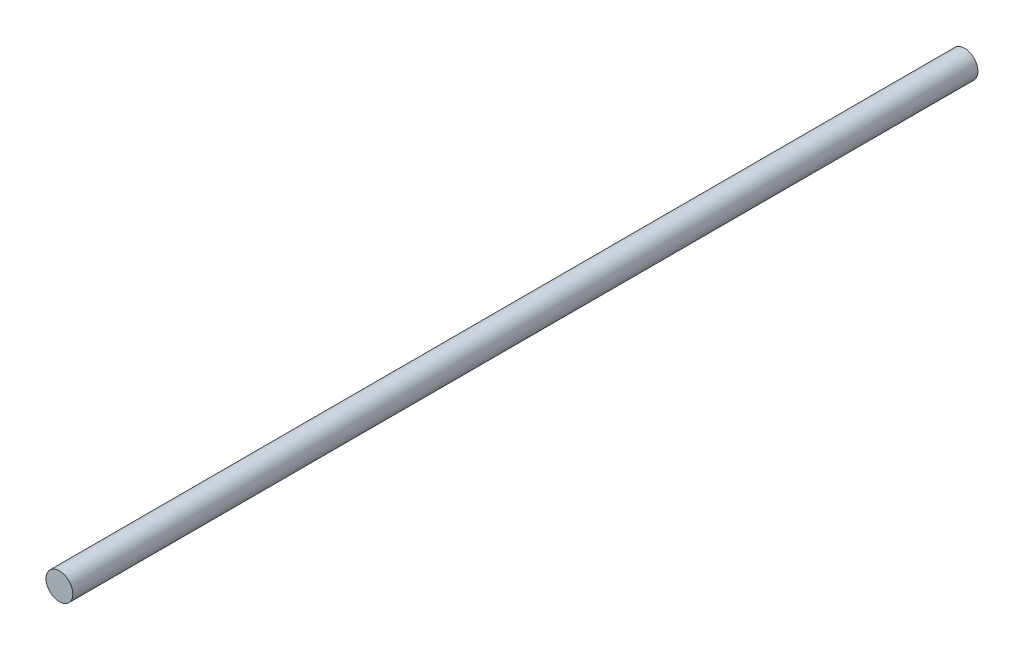
ISO-10303-21;
HEADER;
FILE_DESCRIPTION(('STEP AP214'),'2;1');
FILE_NAME('part.step','',(''),(''),'','','');
FILE_SCHEMA(('AUTOMOTIVE_DESIGN { 1 0 10303 214 1 1 1 1 }'));
ENDSEC;
DATA;
#1=APPLICATION_CONTEXT('core data for automotive mechanical design processes');
#2=APPLICATION_PROTOCOL_DEFINITION('international standard','automotive_design',2000,#1);
#3=PRODUCT_CONTEXT('',#1,'mechanical');
#4=PRODUCT('Part','Part','',(#3));
#5=PRODUCT_RELATED_PRODUCT_CATEGORY('part','',(#4));
#6=PRODUCT_DEFINITION_FORMATION('','',#4);
#7=PRODUCT_DEFINITION_CONTEXT('part definition',#1,'design');
#8=PRODUCT_DEFINITION('design','',#6,#7);
#9=PRODUCT_DEFINITION_SHAPE('','',#8);
#10=(LENGTH_UNIT() NAMED_UNIT(*) SI_UNIT(.MILLI.,.METRE.));
#11=(NAMED_UNIT(*) PLANE_ANGLE_UNIT() SI_UNIT($,.RADIAN.));
#12=(NAMED_UNIT(*) SI_UNIT($,.STERADIAN.) SOLID_ANGLE_UNIT());
#13=UNCERTAINTY_MEASURE_WITH_UNIT(LENGTH_MEASURE(1.E-05),#10,'distance_accuracy_value','');
#14=(GEOMETRIC_REPRESENTATION_CONTEXT(3) GLOBAL_UNCERTAINTY_ASSIGNED_CONTEXT((#13)) GLOBAL_UNIT_ASSIGNED_CONTEXT((#10,
#11,#12)) REPRESENTATION_CONTEXT('',''));
#15=CARTESIAN_POINT('',(0.,0.,0.));
#16=DIRECTION('',(0.,0.,1.));
#17=DIRECTION('',(1.,0.,0.));
#18=AXIS2_PLACEMENT_3D('',#15,#16,#17);
#19=CARTESIAN_POINT('',(0.,0.,321.31));
#20=DIRECTION('',(0.,0.,-1.));
#21=DIRECTION('',(-1.,0.,0.));
#22=AXIS2_PLACEMENT_3D('',#19,#20,#21);
#23=CYLINDRICAL_SURFACE('',#22,4.7625);
#24=CARTESIAN_POINT('',(0.,0.,321.31));
#25=DIRECTION('',(0.,0.,1.));
#26=DIRECTION('',(1.,0.,0.));
#27=AXIS2_PLACEMENT_3D('',#24,#25,#26);
#28=CIRCLE('',#27,4.7625);
#29=CARTESIAN_POINT('',(4.7625,0.,321.31));
#30=VERTEX_POINT('',#29);
#31=EDGE_CURVE('E10',#30,#30,#28,.T.);
#32=ORIENTED_EDGE('',*,*,#31,.F.);
#33=EDGE_LOOP('',(#32));
#34=FACE_BOUND('',#33,.T.);
#35=CARTESIAN_POINT('',(0.,0.,0.));
#36=DIRECTION('',(0.,0.,1.));
#37=DIRECTION('',(1.,0.,0.));
#38=AXIS2_PLACEMENT_3D('',#35,#36,#37);
#39=CIRCLE('',#38,4.7625);
#40=CARTESIAN_POINT('',(4.7625,0.,0.));
#41=VERTEX_POINT('',#40);
#42=EDGE_CURVE('E46',#41,#41,#39,.T.);
#43=ORIENTED_EDGE('',*,*,#42,.T.);
#44=EDGE_LOOP('',(#43));
#45=FACE_BOUND('',#44,.T.);
#46=ADVANCED_FACE('F43',(#34,#45),#23,.T.);
#47=CARTESIAN_POINT('',(0.,0.,321.31));
#48=DIRECTION('',(0.,0.,1.));
#49=DIRECTION('',(1.,0.,0.));
#50=AXIS2_PLACEMENT_3D('',#47,#48,#49);
#51=PLANE('',#50);
#52=ORIENTED_EDGE('',*,*,#31,.T.);
#53=EDGE_LOOP('',(#52));
#54=FACE_BOUND('',#53,.T.);
#55=ADVANCED_FACE('F60',(#54),#51,.T.);
#56=CARTESIAN_POINT('',(0.,0.,0.));
#57=DIRECTION('',(0.,0.,1.));
#58=DIRECTION('',(1.,0.,0.));
#59=AXIS2_PLACEMENT_3D('',#56,#57,#58);
#60=PLANE('',#59);
#61=ORIENTED_EDGE('',*,*,#42,.F.);
#62=EDGE_LOOP('',(#61));
#63=FACE_BOUND('',#62,.T.);
#64=ADVANCED_FACE('F58',(#63),#60,.F.);
#65=CLOSED_SHELL('',(#46,#55,#64));
#66=MANIFOLD_SOLID_BREP('B2',#65);
#67=ADVANCED_BREP_SHAPE_REPRESENTATION('',(#18,#66),#14);
#68=SHAPE_DEFINITION_REPRESENTATION(#9,#67);
ENDSEC;
END-ISO-10303-21;
